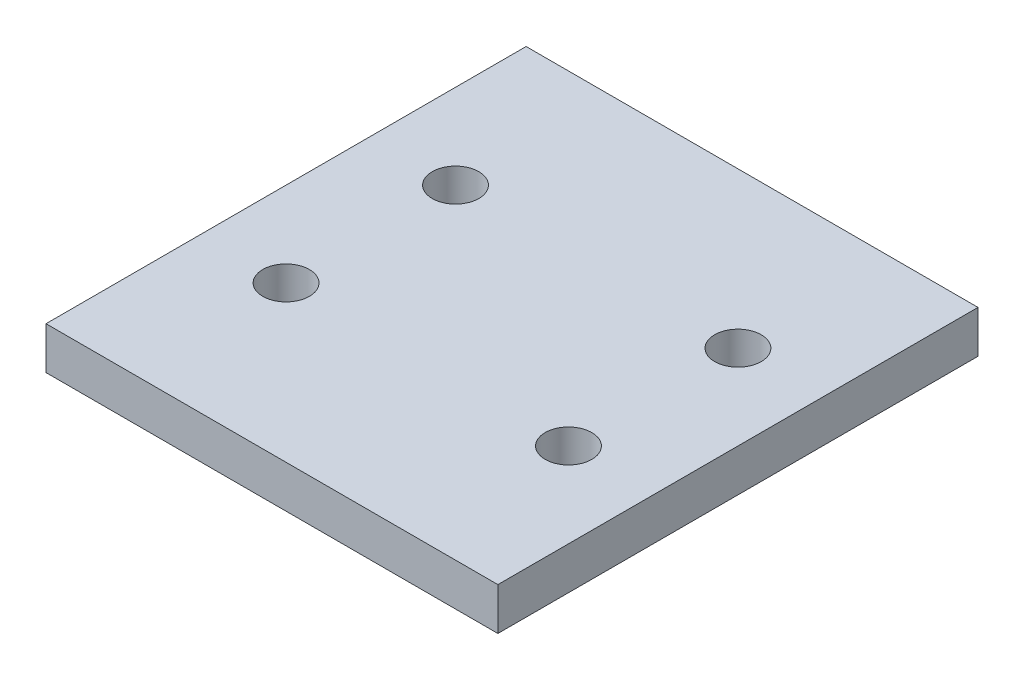
ISO-10303-21;
HEADER;
FILE_DESCRIPTION(('STEP AP214'),'2;1');
FILE_NAME('part.step','',(''),(''),'','','');
FILE_SCHEMA(('AUTOMOTIVE_DESIGN { 1 0 10303 214 1 1 1 1 }'));
ENDSEC;
DATA;
#1=APPLICATION_CONTEXT('core data for automotive mechanical design processes');
#2=APPLICATION_PROTOCOL_DEFINITION('international standard','automotive_design',2000,#1);
#3=PRODUCT_CONTEXT('',#1,'mechanical');
#4=PRODUCT('Part','Part','',(#3));
#5=PRODUCT_RELATED_PRODUCT_CATEGORY('part','',(#4));
#6=PRODUCT_DEFINITION_FORMATION('','',#4);
#7=PRODUCT_DEFINITION_CONTEXT('part definition',#1,'design');
#8=PRODUCT_DEFINITION('design','',#6,#7);
#9=PRODUCT_DEFINITION_SHAPE('','',#8);
#10=(LENGTH_UNIT() NAMED_UNIT(*) SI_UNIT(.MILLI.,.METRE.));
#11=(NAMED_UNIT(*) PLANE_ANGLE_UNIT() SI_UNIT($,.RADIAN.));
#12=(NAMED_UNIT(*) SI_UNIT($,.STERADIAN.) SOLID_ANGLE_UNIT());
#13=UNCERTAINTY_MEASURE_WITH_UNIT(LENGTH_MEASURE(1.E-05),#10,'distance_accuracy_value','');
#14=(GEOMETRIC_REPRESENTATION_CONTEXT(3) GLOBAL_UNCERTAINTY_ASSIGNED_CONTEXT((#13)) GLOBAL_UNIT_ASSIGNED_CONTEXT((#10,
#11,#12)) REPRESENTATION_CONTEXT('',''));
#15=CARTESIAN_POINT('',(0.,0.,0.));
#16=DIRECTION('',(0.,0.,1.));
#17=DIRECTION('',(1.,0.,0.));
#18=AXIS2_PLACEMENT_3D('',#15,#16,#17);
#19=CARTESIAN_POINT('',(0.,3.,0.));
#20=DIRECTION('',(0.,1.,0.));
#21=DIRECTION('',(0.,0.,1.));
#22=AXIS2_PLACEMENT_3D('',#19,#20,#21);
#23=PLANE('',#22);
#24=CARTESIAN_POINT('',(-10.,3.,6.));
#25=DIRECTION('',(0.,1.,0.));
#26=DIRECTION('',(0.,0.,1.));
#27=AXIS2_PLACEMENT_3D('',#24,#25,#26);
#28=CIRCLE('',#27,1.65);
#29=CARTESIAN_POINT('',(-10.,3.,7.65));
#30=VERTEX_POINT('',#29);
#31=EDGE_CURVE('E142',#30,#30,#28,.T.);
#32=ORIENTED_EDGE('',*,*,#31,.F.);
#33=EDGE_LOOP('',(#32));
#34=FACE_BOUND('',#33,.T.);
#35=CARTESIAN_POINT('',(-10.,3.,-6.));
#36=DIRECTION('',(0.,1.,0.));
#37=DIRECTION('',(0.,0.,1.));
#38=AXIS2_PLACEMENT_3D('',#35,#36,#37);
#39=CIRCLE('',#38,1.65);
#40=CARTESIAN_POINT('',(-10.,3.,-4.35));
#41=VERTEX_POINT('',#40);
#42=EDGE_CURVE('E112',#41,#41,#39,.T.);
#43=ORIENTED_EDGE('',*,*,#42,.F.);
#44=EDGE_LOOP('',(#43));
#45=FACE_BOUND('',#44,.T.);
#46=DIRECTION('',(0.,0.,-1.));
#47=VECTOR('',#46,1.);
#48=CARTESIAN_POINT('',(16.,3.,-17.));
#49=LINE('',#48,#47);
#50=CARTESIAN_POINT('',(16.,3.,17.));
#51=VERTEX_POINT('',#50);
#52=CARTESIAN_POINT('',(16.,3.,-17.));
#53=VERTEX_POINT('',#52);
#54=EDGE_CURVE('E92',#51,#53,#49,.T.);
#55=ORIENTED_EDGE('',*,*,#54,.T.);
#56=DIRECTION('',(-1.,0.,0.));
#57=VECTOR('',#56,1.);
#58=CARTESIAN_POINT('',(-16.,3.,-17.));
#59=LINE('',#58,#57);
#60=CARTESIAN_POINT('',(-16.,3.,-17.));
#61=VERTEX_POINT('',#60);
#62=EDGE_CURVE('E87',#53,#61,#59,.T.);
#63=ORIENTED_EDGE('',*,*,#62,.T.);
#64=DIRECTION('',(0.,0.,1.));
#65=VECTOR('',#64,1.);
#66=CARTESIAN_POINT('',(-16.,3.,-17.));
#67=LINE('',#66,#65);
#68=CARTESIAN_POINT('',(-16.,3.,17.));
#69=VERTEX_POINT('',#68);
#70=EDGE_CURVE('E90',#61,#69,#67,.T.);
#71=ORIENTED_EDGE('',*,*,#70,.T.);
#72=DIRECTION('',(1.,0.,0.));
#73=VECTOR('',#72,1.);
#74=CARTESIAN_POINT('',(-16.,3.,17.));
#75=LINE('',#74,#73);
#76=EDGE_CURVE('E57',#69,#51,#75,.T.);
#77=ORIENTED_EDGE('',*,*,#76,.T.);
#78=EDGE_LOOP('',(#55,#63,#71,#77));
#79=FACE_BOUND('',#78,.T.);
#80=CARTESIAN_POINT('',(10.,3.,-6.));
#81=DIRECTION('',(0.,1.,0.));
#82=DIRECTION('',(0.,0.,1.));
#83=AXIS2_PLACEMENT_3D('',#80,#81,#82);
#84=CIRCLE('',#83,1.65);
#85=CARTESIAN_POINT('',(10.,3.,-4.35));
#86=VERTEX_POINT('',#85);
#87=EDGE_CURVE('E134',#86,#86,#84,.T.);
#88=ORIENTED_EDGE('',*,*,#87,.F.);
#89=EDGE_LOOP('',(#88));
#90=FACE_BOUND('',#89,.T.);
#91=CARTESIAN_POINT('',(10.,3.,6.));
#92=DIRECTION('',(0.,1.,0.));
#93=DIRECTION('',(0.,0.,1.));
#94=AXIS2_PLACEMENT_3D('',#91,#92,#93);
#95=CIRCLE('',#94,1.65);
#96=CARTESIAN_POINT('',(10.,3.,7.65));
#97=VERTEX_POINT('',#96);
#98=EDGE_CURVE('E150',#97,#97,#95,.T.);
#99=ORIENTED_EDGE('',*,*,#98,.F.);
#100=EDGE_LOOP('',(#99));
#101=FACE_BOUND('',#100,.T.);
#102=ADVANCED_FACE('F39',(#34,#45,#79,#90,#101),#23,.T.);
#103=CARTESIAN_POINT('',(0.,0.,0.));
#104=DIRECTION('',(0.,1.,0.));
#105=DIRECTION('',(0.,0.,1.));
#106=AXIS2_PLACEMENT_3D('',#103,#104,#105);
#107=PLANE('',#106);
#108=DIRECTION('',(0.,0.,-1.));
#109=VECTOR('',#108,1.);
#110=CARTESIAN_POINT('',(16.,0.,-17.));
#111=LINE('',#110,#109);
#112=CARTESIAN_POINT('',(16.,0.,17.));
#113=VERTEX_POINT('',#112);
#114=CARTESIAN_POINT('',(16.,0.,-17.));
#115=VERTEX_POINT('',#114);
#116=EDGE_CURVE('E108',#113,#115,#111,.T.);
#117=ORIENTED_EDGE('',*,*,#116,.F.);
#118=DIRECTION('',(1.,0.,0.));
#119=VECTOR('',#118,1.);
#120=CARTESIAN_POINT('',(-16.,0.,17.));
#121=LINE('',#120,#119);
#122=CARTESIAN_POINT('',(-16.,0.,17.));
#123=VERTEX_POINT('',#122);
#124=EDGE_CURVE('E80',#123,#113,#121,.T.);
#125=ORIENTED_EDGE('',*,*,#124,.F.);
#126=DIRECTION('',(0.,0.,1.));
#127=VECTOR('',#126,1.);
#128=CARTESIAN_POINT('',(-16.,0.,-17.));
#129=LINE('',#128,#127);
#130=CARTESIAN_POINT('',(-16.,0.,-17.));
#131=VERTEX_POINT('',#130);
#132=EDGE_CURVE('E74',#131,#123,#129,.T.);
#133=ORIENTED_EDGE('',*,*,#132,.F.);
#134=DIRECTION('',(-1.,0.,0.));
#135=VECTOR('',#134,1.);
#136=CARTESIAN_POINT('',(-16.,0.,-17.));
#137=LINE('',#136,#135);
#138=EDGE_CURVE('E97',#115,#131,#137,.T.);
#139=ORIENTED_EDGE('',*,*,#138,.F.);
#140=EDGE_LOOP('',(#117,#125,#133,#139));
#141=FACE_BOUND('',#140,.T.);
#142=CARTESIAN_POINT('',(-10.,0.,-6.));
#143=DIRECTION('',(0.,1.,0.));
#144=DIRECTION('',(0.,0.,1.));
#145=AXIS2_PLACEMENT_3D('',#142,#143,#144);
#146=CIRCLE('',#145,1.65);
#147=CARTESIAN_POINT('',(-10.,0.,-4.35));
#148=VERTEX_POINT('',#147);
#149=EDGE_CURVE('E130',#148,#148,#146,.T.);
#150=ORIENTED_EDGE('',*,*,#149,.T.);
#151=EDGE_LOOP('',(#150));
#152=FACE_BOUND('',#151,.T.);
#153=CARTESIAN_POINT('',(10.,0.,-6.));
#154=DIRECTION('',(0.,1.,0.));
#155=DIRECTION('',(0.,0.,1.));
#156=AXIS2_PLACEMENT_3D('',#153,#154,#155);
#157=CIRCLE('',#156,1.65);
#158=CARTESIAN_POINT('',(10.,0.,-4.35));
#159=VERTEX_POINT('',#158);
#160=EDGE_CURVE('E138',#159,#159,#157,.T.);
#161=ORIENTED_EDGE('',*,*,#160,.T.);
#162=EDGE_LOOP('',(#161));
#163=FACE_BOUND('',#162,.T.);
#164=CARTESIAN_POINT('',(-10.,0.,6.));
#165=DIRECTION('',(0.,1.,0.));
#166=DIRECTION('',(0.,0.,1.));
#167=AXIS2_PLACEMENT_3D('',#164,#165,#166);
#168=CIRCLE('',#167,1.65);
#169=CARTESIAN_POINT('',(-10.,0.,7.65));
#170=VERTEX_POINT('',#169);
#171=EDGE_CURVE('E146',#170,#170,#168,.T.);
#172=ORIENTED_EDGE('',*,*,#171,.T.);
#173=EDGE_LOOP('',(#172));
#174=FACE_BOUND('',#173,.T.);
#175=CARTESIAN_POINT('',(10.,0.,6.));
#176=DIRECTION('',(0.,1.,0.));
#177=DIRECTION('',(0.,0.,1.));
#178=AXIS2_PLACEMENT_3D('',#175,#176,#177);
#179=CIRCLE('',#178,1.65);
#180=CARTESIAN_POINT('',(10.,0.,7.65));
#181=VERTEX_POINT('',#180);
#182=EDGE_CURVE('E154',#181,#181,#179,.T.);
#183=ORIENTED_EDGE('',*,*,#182,.T.);
#184=EDGE_LOOP('',(#183));
#185=FACE_BOUND('',#184,.T.);
#186=ADVANCED_FACE('F125',(#141,#152,#163,#174,#185),#107,.F.);
#187=CARTESIAN_POINT('',(16.,3.,-17.));
#188=DIRECTION('',(-1.,0.,0.));
#189=DIRECTION('',(0.,0.,1.));
#190=AXIS2_PLACEMENT_3D('',#187,#188,#189);
#191=PLANE('',#190);
#192=ORIENTED_EDGE('',*,*,#116,.T.);
#193=DIRECTION('',(0.,-1.,0.));
#194=VECTOR('',#193,1.);
#195=CARTESIAN_POINT('',(16.,3.,-17.));
#196=LINE('',#195,#194);
#197=EDGE_CURVE('E11',#53,#115,#196,.T.);
#198=ORIENTED_EDGE('',*,*,#197,.F.);
#199=ORIENTED_EDGE('',*,*,#54,.F.);
#200=DIRECTION('',(0.,-1.,0.));
#201=VECTOR('',#200,1.);
#202=CARTESIAN_POINT('',(16.,3.,17.));
#203=LINE('',#202,#201);
#204=EDGE_CURVE('E104',#51,#113,#203,.T.);
#205=ORIENTED_EDGE('',*,*,#204,.T.);
#206=EDGE_LOOP('',(#192,#198,#199,#205));
#207=FACE_BOUND('',#206,.T.);
#208=ADVANCED_FACE('F41',(#207),#191,.F.);
#209=CARTESIAN_POINT('',(-16.,3.,-17.));
#210=DIRECTION('',(0.,0.,1.));
#211=DIRECTION('',(1.,0.,0.));
#212=AXIS2_PLACEMENT_3D('',#209,#210,#211);
#213=PLANE('',#212);
#214=ORIENTED_EDGE('',*,*,#138,.T.);
#215=DIRECTION('',(0.,-1.,0.));
#216=VECTOR('',#215,1.);
#217=CARTESIAN_POINT('',(-16.,3.,-17.));
#218=LINE('',#217,#216);
#219=EDGE_CURVE('E49',#61,#131,#218,.T.);
#220=ORIENTED_EDGE('',*,*,#219,.F.);
#221=ORIENTED_EDGE('',*,*,#62,.F.);
#222=ORIENTED_EDGE('',*,*,#197,.T.);
#223=EDGE_LOOP('',(#214,#220,#221,#222));
#224=FACE_BOUND('',#223,.T.);
#225=ADVANCED_FACE('F96',(#224),#213,.F.);
#226=CARTESIAN_POINT('',(-16.,3.,-17.));
#227=DIRECTION('',(1.,0.,0.));
#228=DIRECTION('',(0.,0.,-1.));
#229=AXIS2_PLACEMENT_3D('',#226,#227,#228);
#230=PLANE('',#229);
#231=ORIENTED_EDGE('',*,*,#132,.T.);
#232=DIRECTION('',(0.,-1.,0.));
#233=VECTOR('',#232,1.);
#234=CARTESIAN_POINT('',(-16.,3.,17.));
#235=LINE('',#234,#233);
#236=EDGE_CURVE('E99',#69,#123,#235,.T.);
#237=ORIENTED_EDGE('',*,*,#236,.F.);
#238=ORIENTED_EDGE('',*,*,#70,.F.);
#239=ORIENTED_EDGE('',*,*,#219,.T.);
#240=EDGE_LOOP('',(#231,#237,#238,#239));
#241=FACE_BOUND('',#240,.T.);
#242=ADVANCED_FACE('F100',(#241),#230,.F.);
#243=CARTESIAN_POINT('',(-16.,3.,17.));
#244=DIRECTION('',(0.,0.,-1.));
#245=DIRECTION('',(-1.,0.,0.));
#246=AXIS2_PLACEMENT_3D('',#243,#244,#245);
#247=PLANE('',#246);
#248=ORIENTED_EDGE('',*,*,#124,.T.);
#249=ORIENTED_EDGE('',*,*,#204,.F.);
#250=ORIENTED_EDGE('',*,*,#76,.F.);
#251=ORIENTED_EDGE('',*,*,#236,.T.);
#252=EDGE_LOOP('',(#248,#249,#250,#251));
#253=FACE_BOUND('',#252,.T.);
#254=ADVANCED_FACE('F122',(#253),#247,.F.);
#255=CARTESIAN_POINT('',(-10.,3.,-6.));
#256=DIRECTION('',(0.,-1.,0.));
#257=DIRECTION('',(0.,0.,-1.));
#258=AXIS2_PLACEMENT_3D('',#255,#256,#257);
#259=CYLINDRICAL_SURFACE('',#258,1.65);
#260=ORIENTED_EDGE('',*,*,#42,.T.);
#261=EDGE_LOOP('',(#260));
#262=FACE_BOUND('',#261,.T.);
#263=ORIENTED_EDGE('',*,*,#149,.F.);
#264=EDGE_LOOP('',(#263));
#265=FACE_BOUND('',#264,.T.);
#266=ADVANCED_FACE('F175',(#262,#265),#259,.F.);
#267=CARTESIAN_POINT('',(10.,3.,-6.));
#268=DIRECTION('',(0.,-1.,0.));
#269=DIRECTION('',(0.,0.,-1.));
#270=AXIS2_PLACEMENT_3D('',#267,#268,#269);
#271=CYLINDRICAL_SURFACE('',#270,1.65);
#272=ORIENTED_EDGE('',*,*,#87,.T.);
#273=EDGE_LOOP('',(#272));
#274=FACE_BOUND('',#273,.T.);
#275=ORIENTED_EDGE('',*,*,#160,.F.);
#276=EDGE_LOOP('',(#275));
#277=FACE_BOUND('',#276,.T.);
#278=ADVANCED_FACE('F221',(#274,#277),#271,.F.);
#279=CARTESIAN_POINT('',(-10.,3.,6.));
#280=DIRECTION('',(0.,-1.,0.));
#281=DIRECTION('',(0.,0.,-1.));
#282=AXIS2_PLACEMENT_3D('',#279,#280,#281);
#283=CYLINDRICAL_SURFACE('',#282,1.65);
#284=ORIENTED_EDGE('',*,*,#31,.T.);
#285=EDGE_LOOP('',(#284));
#286=FACE_BOUND('',#285,.T.);
#287=ORIENTED_EDGE('',*,*,#171,.F.);
#288=EDGE_LOOP('',(#287));
#289=FACE_BOUND('',#288,.T.);
#290=ADVANCED_FACE('F229',(#286,#289),#283,.F.);
#291=CARTESIAN_POINT('',(10.,3.,6.));
#292=DIRECTION('',(0.,-1.,0.));
#293=DIRECTION('',(0.,0.,-1.));
#294=AXIS2_PLACEMENT_3D('',#291,#292,#293);
#295=CYLINDRICAL_SURFACE('',#294,1.65);
#296=ORIENTED_EDGE('',*,*,#98,.T.);
#297=EDGE_LOOP('',(#296));
#298=FACE_BOUND('',#297,.T.);
#299=ORIENTED_EDGE('',*,*,#182,.F.);
#300=EDGE_LOOP('',(#299));
#301=FACE_BOUND('',#300,.T.);
#302=ADVANCED_FACE('F162',(#298,#301),#295,.F.);
#303=CLOSED_SHELL('',(#102,#186,#208,#225,#242,#254,#266,#278,#290,#302));
#304=MANIFOLD_SOLID_BREP('B2',#303);
#305=ADVANCED_BREP_SHAPE_REPRESENTATION('',(#18,#304),#14);
#306=SHAPE_DEFINITION_REPRESENTATION(#9,#305);
ENDSEC;
END-ISO-10303-21;
